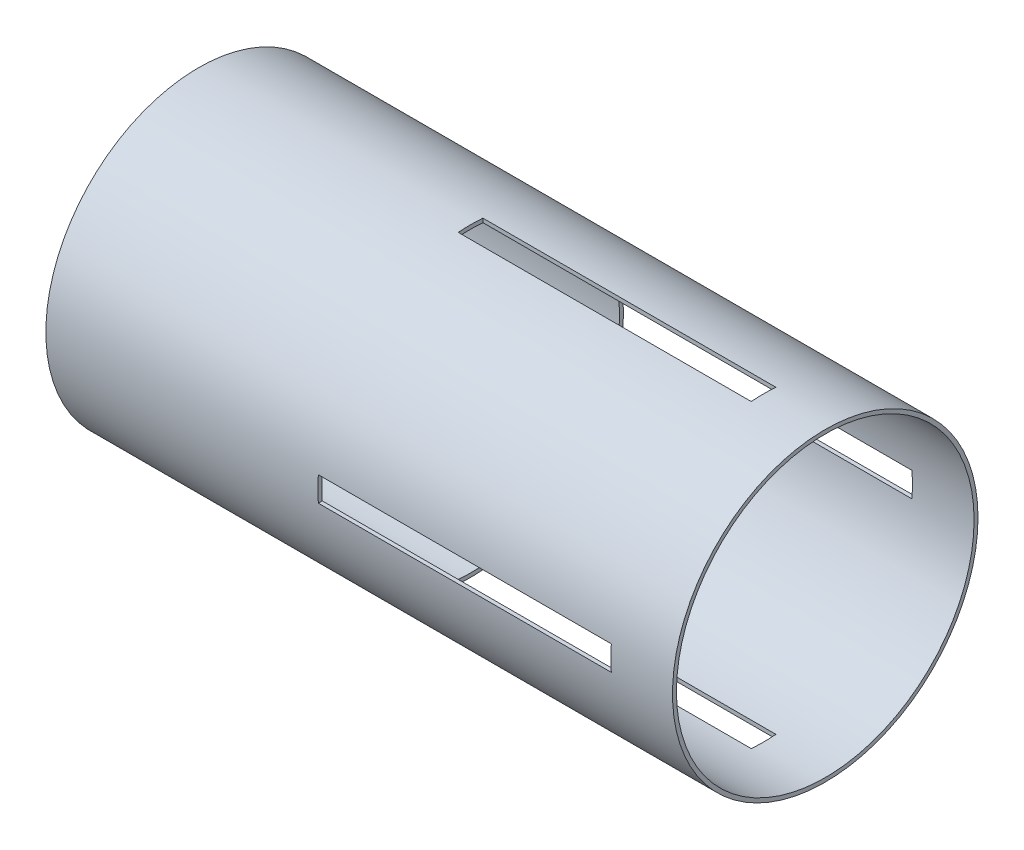
ISO-10303-21;
HEADER;
FILE_DESCRIPTION(('STEP AP214'),'2;1');
FILE_NAME('part.step','',(''),(''),'','','');
FILE_SCHEMA(('AUTOMOTIVE_DESIGN { 1 0 10303 214 1 1 1 1 }'));
ENDSEC;
DATA;
#1=APPLICATION_CONTEXT('core data for automotive mechanical design processes');
#2=APPLICATION_PROTOCOL_DEFINITION('international standard','automotive_design',2000,#1);
#3=PRODUCT_CONTEXT('',#1,'mechanical');
#4=PRODUCT('Part','Part','',(#3));
#5=PRODUCT_RELATED_PRODUCT_CATEGORY('part','',(#4));
#6=PRODUCT_DEFINITION_FORMATION('','',#4);
#7=PRODUCT_DEFINITION_CONTEXT('part definition',#1,'design');
#8=PRODUCT_DEFINITION('design','',#6,#7);
#9=PRODUCT_DEFINITION_SHAPE('','',#8);
#10=(LENGTH_UNIT() NAMED_UNIT(*) SI_UNIT(.MILLI.,.METRE.));
#11=(NAMED_UNIT(*) PLANE_ANGLE_UNIT() SI_UNIT($,.RADIAN.));
#12=(NAMED_UNIT(*) SI_UNIT($,.STERADIAN.) SOLID_ANGLE_UNIT());
#13=UNCERTAINTY_MEASURE_WITH_UNIT(LENGTH_MEASURE(1.E-05),#10,'distance_accuracy_value','');
#14=(GEOMETRIC_REPRESENTATION_CONTEXT(3) GLOBAL_UNCERTAINTY_ASSIGNED_CONTEXT((#13)) GLOBAL_UNIT_ASSIGNED_CONTEXT((#10,
#11,#12)) REPRESENTATION_CONTEXT('',''));
#15=CARTESIAN_POINT('',(0.,0.,0.));
#16=DIRECTION('',(0.,0.,1.));
#17=DIRECTION('',(1.,0.,0.));
#18=AXIS2_PLACEMENT_3D('',#15,#16,#17);
#19=CARTESIAN_POINT('',(203.2,0.,0.));
#20=DIRECTION('',(-1.,0.,0.));
#21=DIRECTION('',(0.,0.,1.));
#22=AXIS2_PLACEMENT_3D('',#19,#20,#21);
#23=CYLINDRICAL_SURFACE('',#22,48.26);
#24=CARTESIAN_POINT('',(203.2,0.,0.));
#25=DIRECTION('',(1.,0.,0.));
#26=DIRECTION('',(0.,0.,-1.));
#27=AXIS2_PLACEMENT_3D('',#24,#25,#26);
#28=CIRCLE('',#27,48.26);
#29=CARTESIAN_POINT('',(203.2,0.,-48.26));
#30=VERTEX_POINT('',#29);
#31=EDGE_CURVE('E220',#30,#30,#28,.T.);
#32=ORIENTED_EDGE('',*,*,#31,.T.);
#33=EDGE_LOOP('',(#32));
#34=FACE_BOUND('',#33,.T.);
#35=CARTESIAN_POINT('',(0.,0.,0.));
#36=DIRECTION('',(1.,0.,0.));
#37=DIRECTION('',(0.,0.,-1.));
#38=AXIS2_PLACEMENT_3D('',#35,#36,#37);
#39=CIRCLE('',#38,48.26);
#40=CARTESIAN_POINT('',(0.,0.,-48.26));
#41=VERTEX_POINT('',#40);
#42=EDGE_CURVE('E219',#41,#41,#39,.T.);
#43=ORIENTED_EDGE('',*,*,#42,.F.);
#44=EDGE_LOOP('',(#43));
#45=FACE_BOUND('',#44,.T.);
#46=CARTESIAN_POINT('',(183.2,0.,0.));
#47=DIRECTION('',(1.,0.,0.));
#48=DIRECTION('',(0.,0.,-1.));
#49=AXIS2_PLACEMENT_3D('',#46,#47,#48);
#50=CIRCLE('',#49,48.26);
#51=CARTESIAN_POINT('',(183.2,48.0939455649045,-4.));
#52=VERTEX_POINT('',#51);
#53=CARTESIAN_POINT('',(183.2,48.0939455649045,4.));
#54=VERTEX_POINT('',#53);
#55=EDGE_CURVE('E216',#52,#54,#50,.T.);
#56=ORIENTED_EDGE('',*,*,#55,.F.);
#57=DIRECTION('',(-1.,0.,0.));
#58=VECTOR('',#57,1.);
#59=CARTESIAN_POINT('',(203.2,48.0939455649045,-4.));
#60=LINE('',#59,#58);
#61=CARTESIAN_POINT('',(88.2,48.0939455649045,-4.));
#62=VERTEX_POINT('',#61);
#63=EDGE_CURVE('E211',#52,#62,#60,.T.);
#64=ORIENTED_EDGE('',*,*,#63,.T.);
#65=CARTESIAN_POINT('',(88.2,0.,0.));
#66=DIRECTION('',(-1.,0.,0.));
#67=DIRECTION('',(0.,0.,1.));
#68=AXIS2_PLACEMENT_3D('',#65,#66,#67);
#69=CIRCLE('',#68,48.26);
#70=CARTESIAN_POINT('',(88.2,48.0939455649045,4.));
#71=VERTEX_POINT('',#70);
#72=EDGE_CURVE('E214',#71,#62,#69,.T.);
#73=ORIENTED_EDGE('',*,*,#72,.F.);
#74=DIRECTION('',(-1.,0.,0.));
#75=VECTOR('',#74,1.);
#76=CARTESIAN_POINT('',(203.2,48.0939455649045,4.));
#77=LINE('',#76,#75);
#78=EDGE_CURVE('E205',#54,#71,#77,.T.);
#79=ORIENTED_EDGE('',*,*,#78,.F.);
#80=EDGE_LOOP('',(#56,#64,#73,#79));
#81=FACE_BOUND('',#80,.T.);
#82=CARTESIAN_POINT('',(183.2,0.,0.));
#83=DIRECTION('',(1.,0.,0.));
#84=DIRECTION('',(0.,0.,-1.));
#85=AXIS2_PLACEMENT_3D('',#82,#83,#84);
#86=CIRCLE('',#85,48.26);
#87=CARTESIAN_POINT('',(183.2,4.0000000000005,48.0939455649045));
#88=VERTEX_POINT('',#87);
#89=CARTESIAN_POINT('',(183.2,-3.9999999999995,48.0939455649046));
#90=VERTEX_POINT('',#89);
#91=EDGE_CURVE('E174',#88,#90,#86,.T.);
#92=ORIENTED_EDGE('',*,*,#91,.F.);
#93=DIRECTION('',(-1.,0.,0.));
#94=VECTOR('',#93,1.);
#95=CARTESIAN_POINT('',(203.2,4.0000000000005,48.0939455649045));
#96=LINE('',#95,#94);
#97=CARTESIAN_POINT('',(88.2,4.0000000000005,48.0939455649045));
#98=VERTEX_POINT('',#97);
#99=EDGE_CURVE('E161',#88,#98,#96,.T.);
#100=ORIENTED_EDGE('',*,*,#99,.T.);
#101=CARTESIAN_POINT('',(88.2,0.,0.));
#102=DIRECTION('',(-1.,0.,0.));
#103=DIRECTION('',(0.,0.,1.));
#104=AXIS2_PLACEMENT_3D('',#101,#102,#103);
#105=CIRCLE('',#104,48.26);
#106=CARTESIAN_POINT('',(88.2,-3.9999999999995,48.0939455649046));
#107=VERTEX_POINT('',#106);
#108=EDGE_CURVE('E167',#107,#98,#105,.T.);
#109=ORIENTED_EDGE('',*,*,#108,.F.);
#110=DIRECTION('',(-1.,0.,0.));
#111=VECTOR('',#110,1.);
#112=CARTESIAN_POINT('',(203.2,-3.9999999999995,48.0939455649046));
#113=LINE('',#112,#111);
#114=EDGE_CURVE('E150',#90,#107,#113,.T.);
#115=ORIENTED_EDGE('',*,*,#114,.F.);
#116=EDGE_LOOP('',(#92,#100,#109,#115));
#117=FACE_BOUND('',#116,.T.);
#118=CARTESIAN_POINT('',(183.2,0.,0.));
#119=DIRECTION('',(1.,0.,0.));
#120=DIRECTION('',(0.,0.,-1.));
#121=AXIS2_PLACEMENT_3D('',#118,#119,#120);
#122=CIRCLE('',#121,48.26);
#123=CARTESIAN_POINT('',(183.2,-48.0939455649045,4.));
#124=VERTEX_POINT('',#123);
#125=CARTESIAN_POINT('',(183.2,-48.0939455649045,-4.));
#126=VERTEX_POINT('',#125);
#127=EDGE_CURVE('E186',#124,#126,#122,.T.);
#128=ORIENTED_EDGE('',*,*,#127,.F.);
#129=DIRECTION('',(-1.,0.,0.));
#130=VECTOR('',#129,1.);
#131=CARTESIAN_POINT('',(203.2,-48.0939455649045,4.));
#132=LINE('',#131,#130);
#133=CARTESIAN_POINT('',(88.2,-48.0939455649045,4.));
#134=VERTEX_POINT('',#133);
#135=EDGE_CURVE('E181',#124,#134,#132,.T.);
#136=ORIENTED_EDGE('',*,*,#135,.T.);
#137=CARTESIAN_POINT('',(88.2,0.,0.));
#138=DIRECTION('',(-1.,0.,0.));
#139=DIRECTION('',(0.,0.,1.));
#140=AXIS2_PLACEMENT_3D('',#137,#138,#139);
#141=CIRCLE('',#140,48.26);
#142=CARTESIAN_POINT('',(88.2,-48.0939455649045,-4.));
#143=VERTEX_POINT('',#142);
#144=EDGE_CURVE('E184',#143,#134,#141,.T.);
#145=ORIENTED_EDGE('',*,*,#144,.F.);
#146=DIRECTION('',(-1.,0.,0.));
#147=VECTOR('',#146,1.);
#148=CARTESIAN_POINT('',(203.2,-48.0939455649045,-4.));
#149=LINE('',#148,#147);
#150=EDGE_CURVE('E176',#126,#143,#149,.T.);
#151=ORIENTED_EDGE('',*,*,#150,.F.);
#152=EDGE_LOOP('',(#128,#136,#145,#151));
#153=FACE_BOUND('',#152,.T.);
#154=CARTESIAN_POINT('',(183.2,0.,0.));
#155=DIRECTION('',(1.,0.,0.));
#156=DIRECTION('',(0.,0.,-1.));
#157=AXIS2_PLACEMENT_3D('',#154,#155,#156);
#158=CIRCLE('',#157,48.26);
#159=CARTESIAN_POINT('',(183.2,-4.00000000000017,-48.0939455649045));
#160=VERTEX_POINT('',#159);
#161=CARTESIAN_POINT('',(183.2,3.99999999999983,-48.0939455649045));
#162=VERTEX_POINT('',#161);
#163=EDGE_CURVE('E195',#160,#162,#158,.T.);
#164=ORIENTED_EDGE('',*,*,#163,.F.);
#165=DIRECTION('',(-1.,0.,0.));
#166=VECTOR('',#165,1.);
#167=CARTESIAN_POINT('',(203.2,-4.00000000000017,-48.0939455649045));
#168=LINE('',#167,#166);
#169=CARTESIAN_POINT('',(88.2,-4.00000000000017,-48.0939455649045));
#170=VERTEX_POINT('',#169);
#171=EDGE_CURVE('E190',#160,#170,#168,.T.);
#172=ORIENTED_EDGE('',*,*,#171,.T.);
#173=CARTESIAN_POINT('',(88.2,0.,0.));
#174=DIRECTION('',(-1.,0.,0.));
#175=DIRECTION('',(0.,0.,1.));
#176=AXIS2_PLACEMENT_3D('',#173,#174,#175);
#177=CIRCLE('',#176,48.26);
#178=CARTESIAN_POINT('',(88.2,3.99999999999983,-48.0939455649045));
#179=VERTEX_POINT('',#178);
#180=EDGE_CURVE('E193',#179,#170,#177,.T.);
#181=ORIENTED_EDGE('',*,*,#180,.F.);
#182=DIRECTION('',(-1.,0.,0.));
#183=VECTOR('',#182,1.);
#184=CARTESIAN_POINT('',(203.2,3.99999999999983,-48.0939455649045));
#185=LINE('',#184,#183);
#186=EDGE_CURVE('E188',#162,#179,#185,.T.);
#187=ORIENTED_EDGE('',*,*,#186,.F.);
#188=EDGE_LOOP('',(#164,#172,#181,#187));
#189=FACE_BOUND('',#188,.T.);
#190=ADVANCED_FACE('F39',(#34,#45,#81,#117,#153,#189),#23,.F.);
#191=CARTESIAN_POINT('',(203.2,0.,0.));
#192=DIRECTION('',(-1.,0.,0.));
#193=DIRECTION('',(0.,0.,1.));
#194=AXIS2_PLACEMENT_3D('',#191,#192,#193);
#195=CYLINDRICAL_SURFACE('',#194,49.53);
#196=DIRECTION('',(-1.,0.,0.));
#197=VECTOR('',#196,1.);
#198=CARTESIAN_POINT('',(203.2,4.00000000000052,49.3682175088386));
#199=LINE('',#198,#197);
#200=CARTESIAN_POINT('',(183.2,4.00000000000052,49.3682175088386));
#201=VERTEX_POINT('',#200);
#202=CARTESIAN_POINT('',(88.2,4.00000000000052,49.3682175088386));
#203=VERTEX_POINT('',#202);
#204=EDGE_CURVE('E248',#201,#203,#199,.T.);
#205=ORIENTED_EDGE('',*,*,#204,.F.);
#206=CARTESIAN_POINT('',(183.2,0.,0.));
#207=DIRECTION('',(1.,0.,0.));
#208=DIRECTION('',(0.,0.,-1.));
#209=AXIS2_PLACEMENT_3D('',#206,#207,#208);
#210=CIRCLE('',#209,49.53);
#211=CARTESIAN_POINT('',(183.2,-3.99999999999948,49.3682175088387));
#212=VERTEX_POINT('',#211);
#213=EDGE_CURVE('E245',#201,#212,#210,.T.);
#214=ORIENTED_EDGE('',*,*,#213,.T.);
#215=DIRECTION('',(-1.,0.,0.));
#216=VECTOR('',#215,1.);
#217=CARTESIAN_POINT('',(203.2,-3.99999999999948,49.3682175088387));
#218=LINE('',#217,#216);
#219=CARTESIAN_POINT('',(88.2,-3.99999999999948,49.3682175088387));
#220=VERTEX_POINT('',#219);
#221=EDGE_CURVE('E242',#212,#220,#218,.T.);
#222=ORIENTED_EDGE('',*,*,#221,.T.);
#223=CARTESIAN_POINT('',(88.2,0.,0.));
#224=DIRECTION('',(-1.,0.,0.));
#225=DIRECTION('',(0.,0.,1.));
#226=AXIS2_PLACEMENT_3D('',#223,#224,#225);
#227=CIRCLE('',#226,49.53);
#228=EDGE_CURVE('E169',#220,#203,#227,.T.);
#229=ORIENTED_EDGE('',*,*,#228,.T.);
#230=EDGE_LOOP('',(#205,#214,#222,#229));
#231=FACE_BOUND('',#230,.T.);
#232=CARTESIAN_POINT('',(0.,0.,0.));
#233=DIRECTION('',(1.,0.,0.));
#234=DIRECTION('',(0.,0.,-1.));
#235=AXIS2_PLACEMENT_3D('',#232,#233,#234);
#236=CIRCLE('',#235,49.53);
#237=CARTESIAN_POINT('',(0.,0.,-49.53));
#238=VERTEX_POINT('',#237);
#239=EDGE_CURVE('E224',#238,#238,#236,.T.);
#240=ORIENTED_EDGE('',*,*,#239,.T.);
#241=EDGE_LOOP('',(#240));
#242=FACE_BOUND('',#241,.T.);
#243=CARTESIAN_POINT('',(203.2,0.,0.));
#244=DIRECTION('',(1.,0.,0.));
#245=DIRECTION('',(0.,0.,-1.));
#246=AXIS2_PLACEMENT_3D('',#243,#244,#245);
#247=CIRCLE('',#246,49.53);
#248=CARTESIAN_POINT('',(203.2,0.,-49.53));
#249=VERTEX_POINT('',#248);
#250=EDGE_CURVE('E223',#249,#249,#247,.T.);
#251=ORIENTED_EDGE('',*,*,#250,.F.);
#252=EDGE_LOOP('',(#251));
#253=FACE_BOUND('',#252,.T.);
#254=CARTESIAN_POINT('',(88.2,0.,0.));
#255=DIRECTION('',(-1.,0.,0.));
#256=DIRECTION('',(0.,0.,1.));
#257=AXIS2_PLACEMENT_3D('',#254,#255,#256);
#258=CIRCLE('',#257,49.53);
#259=CARTESIAN_POINT('',(88.2,49.3682175088386,4.));
#260=VERTEX_POINT('',#259);
#261=CARTESIAN_POINT('',(88.2,49.3682175088386,-4.));
#262=VERTEX_POINT('',#261);
#263=EDGE_CURVE('E234',#260,#262,#258,.T.);
#264=ORIENTED_EDGE('',*,*,#263,.T.);
#265=DIRECTION('',(-1.,0.,0.));
#266=VECTOR('',#265,1.);
#267=CARTESIAN_POINT('',(203.2,49.3682175088386,-4.));
#268=LINE('',#267,#266);
#269=CARTESIAN_POINT('',(183.2,49.3682175088386,-4.));
#270=VERTEX_POINT('',#269);
#271=EDGE_CURVE('E239',#270,#262,#268,.T.);
#272=ORIENTED_EDGE('',*,*,#271,.F.);
#273=CARTESIAN_POINT('',(183.2,0.,0.));
#274=DIRECTION('',(1.,0.,0.));
#275=DIRECTION('',(0.,0.,-1.));
#276=AXIS2_PLACEMENT_3D('',#273,#274,#275);
#277=CIRCLE('',#276,49.53);
#278=CARTESIAN_POINT('',(183.2,49.3682175088386,4.));
#279=VERTEX_POINT('',#278);
#280=EDGE_CURVE('E236',#270,#279,#277,.T.);
#281=ORIENTED_EDGE('',*,*,#280,.T.);
#282=DIRECTION('',(-1.,0.,0.));
#283=VECTOR('',#282,1.);
#284=CARTESIAN_POINT('',(203.2,49.3682175088386,4.));
#285=LINE('',#284,#283);
#286=EDGE_CURVE('E227',#279,#260,#285,.T.);
#287=ORIENTED_EDGE('',*,*,#286,.T.);
#288=EDGE_LOOP('',(#264,#272,#281,#287));
#289=FACE_BOUND('',#288,.T.);
#290=CARTESIAN_POINT('',(88.2,0.,0.));
#291=DIRECTION('',(-1.,0.,0.));
#292=DIRECTION('',(0.,0.,1.));
#293=AXIS2_PLACEMENT_3D('',#290,#291,#292);
#294=CIRCLE('',#293,49.53);
#295=CARTESIAN_POINT('',(88.2,-49.3682175088386,-4.));
#296=VERTEX_POINT('',#295);
#297=CARTESIAN_POINT('',(88.2,-49.3682175088386,4.));
#298=VERTEX_POINT('',#297);
#299=EDGE_CURVE('E254',#296,#298,#294,.T.);
#300=ORIENTED_EDGE('',*,*,#299,.T.);
#301=DIRECTION('',(-1.,0.,0.));
#302=VECTOR('',#301,1.);
#303=CARTESIAN_POINT('',(203.2,-49.3682175088386,4.));
#304=LINE('',#303,#302);
#305=CARTESIAN_POINT('',(183.2,-49.3682175088386,4.));
#306=VERTEX_POINT('',#305);
#307=EDGE_CURVE('E259',#306,#298,#304,.T.);
#308=ORIENTED_EDGE('',*,*,#307,.F.);
#309=CARTESIAN_POINT('',(183.2,0.,0.));
#310=DIRECTION('',(1.,0.,0.));
#311=DIRECTION('',(0.,0.,-1.));
#312=AXIS2_PLACEMENT_3D('',#309,#310,#311);
#313=CIRCLE('',#312,49.53);
#314=CARTESIAN_POINT('',(183.2,-49.3682175088386,-4.));
#315=VERTEX_POINT('',#314);
#316=EDGE_CURVE('E256',#306,#315,#313,.T.);
#317=ORIENTED_EDGE('',*,*,#316,.T.);
#318=DIRECTION('',(-1.,0.,0.));
#319=VECTOR('',#318,1.);
#320=CARTESIAN_POINT('',(203.2,-49.3682175088386,-4.));
#321=LINE('',#320,#319);
#322=EDGE_CURVE('E251',#315,#296,#321,.T.);
#323=ORIENTED_EDGE('',*,*,#322,.T.);
#324=EDGE_LOOP('',(#300,#308,#317,#323));
#325=FACE_BOUND('',#324,.T.);
#326=DIRECTION('',(-1.,0.,0.));
#327=VECTOR('',#326,1.);
#328=CARTESIAN_POINT('',(203.2,-4.00000000000017,-49.3682175088386));
#329=LINE('',#328,#327);
#330=CARTESIAN_POINT('',(183.2,-4.00000000000017,-49.3682175088386));
#331=VERTEX_POINT('',#330);
#332=CARTESIAN_POINT('',(88.2,-4.00000000000017,-49.3682175088386));
#333=VERTEX_POINT('',#332);
#334=EDGE_CURVE('E11',#331,#333,#329,.T.);
#335=ORIENTED_EDGE('',*,*,#334,.F.);
#336=CARTESIAN_POINT('',(183.2,0.,0.));
#337=DIRECTION('',(1.,0.,0.));
#338=DIRECTION('',(0.,0.,-1.));
#339=AXIS2_PLACEMENT_3D('',#336,#337,#338);
#340=CIRCLE('',#339,49.53);
#341=CARTESIAN_POINT('',(183.2,3.99999999999983,-49.3682175088386));
#342=VERTEX_POINT('',#341);
#343=EDGE_CURVE('E46',#331,#342,#340,.T.);
#344=ORIENTED_EDGE('',*,*,#343,.T.);
#345=DIRECTION('',(-1.,0.,0.));
#346=VECTOR('',#345,1.);
#347=CARTESIAN_POINT('',(203.2,3.99999999999983,-49.3682175088386));
#348=LINE('',#347,#346);
#349=CARTESIAN_POINT('',(88.2,3.99999999999983,-49.3682175088386));
#350=VERTEX_POINT('',#349);
#351=EDGE_CURVE('E262',#342,#350,#348,.T.);
#352=ORIENTED_EDGE('',*,*,#351,.T.);
#353=CARTESIAN_POINT('',(88.2,0.,0.));
#354=DIRECTION('',(-1.,0.,0.));
#355=DIRECTION('',(0.,0.,1.));
#356=AXIS2_PLACEMENT_3D('',#353,#354,#355);
#357=CIRCLE('',#356,49.53);
#358=EDGE_CURVE('E265',#350,#333,#357,.T.);
#359=ORIENTED_EDGE('',*,*,#358,.T.);
#360=EDGE_LOOP('',(#335,#344,#352,#359));
#361=FACE_BOUND('',#360,.T.);
#362=ADVANCED_FACE('F269',(#231,#242,#253,#289,#325,#361),#195,.T.);
#363=CARTESIAN_POINT('',(203.2,0.,0.));
#364=DIRECTION('',(1.,0.,0.));
#365=DIRECTION('',(0.,0.,-1.));
#366=AXIS2_PLACEMENT_3D('',#363,#364,#365);
#367=PLANE('',#366);
#368=ORIENTED_EDGE('',*,*,#31,.F.);
#369=EDGE_LOOP('',(#368));
#370=FACE_BOUND('',#369,.T.);
#371=ORIENTED_EDGE('',*,*,#250,.T.);
#372=EDGE_LOOP('',(#371));
#373=FACE_BOUND('',#372,.T.);
#374=ADVANCED_FACE('F325',(#370,#373),#367,.T.);
#375=CARTESIAN_POINT('',(0.,0.,0.));
#376=DIRECTION('',(1.,0.,0.));
#377=DIRECTION('',(0.,0.,-1.));
#378=AXIS2_PLACEMENT_3D('',#375,#376,#377);
#379=PLANE('',#378);
#380=ORIENTED_EDGE('',*,*,#42,.T.);
#381=EDGE_LOOP('',(#380));
#382=FACE_BOUND('',#381,.T.);
#383=ORIENTED_EDGE('',*,*,#239,.F.);
#384=EDGE_LOOP('',(#383));
#385=FACE_BOUND('',#384,.T.);
#386=ADVANCED_FACE('F358',(#382,#385),#379,.F.);
#387=CARTESIAN_POINT('',(183.2,45.53,-4.));
#388=DIRECTION('',(1.,0.,0.));
#389=DIRECTION('',(0.,0.,-1.));
#390=AXIS2_PLACEMENT_3D('',#387,#388,#389);
#391=PLANE('',#390);
#392=ORIENTED_EDGE('',*,*,#55,.T.);
#393=DIRECTION('',(0.,1.,0.));
#394=VECTOR('',#393,1.);
#395=CARTESIAN_POINT('',(183.2,45.53,4.));
#396=LINE('',#395,#394);
#397=EDGE_CURVE('E202',#54,#279,#396,.T.);
#398=ORIENTED_EDGE('',*,*,#397,.T.);
#399=ORIENTED_EDGE('',*,*,#280,.F.);
#400=DIRECTION('',(0.,1.,0.));
#401=VECTOR('',#400,1.);
#402=CARTESIAN_POINT('',(183.2,45.53,-4.));
#403=LINE('',#402,#401);
#404=EDGE_CURVE('E201',#52,#270,#403,.T.);
#405=ORIENTED_EDGE('',*,*,#404,.F.);
#406=EDGE_LOOP('',(#392,#398,#399,#405));
#407=FACE_BOUND('',#406,.T.);
#408=ADVANCED_FACE('F335',(#407),#391,.F.);
#409=CARTESIAN_POINT('',(88.2,49.53,-4.));
#410=DIRECTION('',(-1.,0.,0.));
#411=DIRECTION('',(0.,0.,1.));
#412=AXIS2_PLACEMENT_3D('',#409,#410,#411);
#413=PLANE('',#412);
#414=ORIENTED_EDGE('',*,*,#72,.T.);
#415=DIRECTION('',(0.,-1.,0.));
#416=VECTOR('',#415,1.);
#417=CARTESIAN_POINT('',(88.2,49.53,-4.));
#418=LINE('',#417,#416);
#419=EDGE_CURVE('E198',#262,#62,#418,.T.);
#420=ORIENTED_EDGE('',*,*,#419,.F.);
#421=ORIENTED_EDGE('',*,*,#263,.F.);
#422=DIRECTION('',(0.,-1.,0.));
#423=VECTOR('',#422,1.);
#424=CARTESIAN_POINT('',(88.2,49.53,4.));
#425=LINE('',#424,#423);
#426=EDGE_CURVE('E197',#260,#71,#425,.T.);
#427=ORIENTED_EDGE('',*,*,#426,.T.);
#428=EDGE_LOOP('',(#414,#420,#421,#427));
#429=FACE_BOUND('',#428,.T.);
#430=ADVANCED_FACE('F344',(#429),#413,.F.);
#431=CARTESIAN_POINT('',(0.,0.,-4.));
#432=DIRECTION('',(0.,0.,1.));
#433=DIRECTION('',(1.,0.,0.));
#434=AXIS2_PLACEMENT_3D('',#431,#432,#433);
#435=PLANE('',#434);
#436=ORIENTED_EDGE('',*,*,#404,.T.);
#437=ORIENTED_EDGE('',*,*,#271,.T.);
#438=ORIENTED_EDGE('',*,*,#419,.T.);
#439=ORIENTED_EDGE('',*,*,#63,.F.);
#440=EDGE_LOOP('',(#436,#437,#438,#439));
#441=FACE_BOUND('',#440,.T.);
#442=ADVANCED_FACE('F338',(#441),#435,.T.);
#443=CARTESIAN_POINT('',(0.,0.,4.));
#444=DIRECTION('',(0.,0.,1.));
#445=DIRECTION('',(1.,0.,0.));
#446=AXIS2_PLACEMENT_3D('',#443,#444,#445);
#447=PLANE('',#446);
#448=ORIENTED_EDGE('',*,*,#78,.T.);
#449=ORIENTED_EDGE('',*,*,#426,.F.);
#450=ORIENTED_EDGE('',*,*,#286,.F.);
#451=ORIENTED_EDGE('',*,*,#397,.F.);
#452=EDGE_LOOP('',(#448,#449,#450,#451));
#453=FACE_BOUND('',#452,.T.);
#454=ADVANCED_FACE('F346',(#453),#447,.F.);
#455=CARTESIAN_POINT('',(183.2,4.00000000000048,45.5299999999999));
#456=DIRECTION('',(1.,0.,0.));
#457=DIRECTION('',(0.,0.,-1.));
#458=AXIS2_PLACEMENT_3D('',#455,#456,#457);
#459=PLANE('',#458);
#460=ORIENTED_EDGE('',*,*,#91,.T.);
#461=DIRECTION('',(0.,0.,1.));
#462=VECTOR('',#461,1.);
#463=CARTESIAN_POINT('',(183.2,-3.99999999999952,45.53));
#464=LINE('',#463,#462);
#465=EDGE_CURVE('E156',#90,#212,#464,.T.);
#466=ORIENTED_EDGE('',*,*,#465,.T.);
#467=ORIENTED_EDGE('',*,*,#213,.F.);
#468=DIRECTION('',(0.,0.,1.));
#469=VECTOR('',#468,1.);
#470=CARTESIAN_POINT('',(183.2,4.00000000000048,45.5299999999999));
#471=LINE('',#470,#469);
#472=EDGE_CURVE('E296',#88,#201,#471,.T.);
#473=ORIENTED_EDGE('',*,*,#472,.F.);
#474=EDGE_LOOP('',(#460,#466,#467,#473));
#475=FACE_BOUND('',#474,.T.);
#476=ADVANCED_FACE('F303',(#475),#459,.F.);
#477=CARTESIAN_POINT('',(88.2,4.00000000000052,49.5299999999999));
#478=DIRECTION('',(-1.,0.,0.));
#479=DIRECTION('',(0.,0.,1.));
#480=AXIS2_PLACEMENT_3D('',#477,#478,#479);
#481=PLANE('',#480);
#482=ORIENTED_EDGE('',*,*,#108,.T.);
#483=DIRECTION('',(0.,0.,-1.));
#484=VECTOR('',#483,1.);
#485=CARTESIAN_POINT('',(88.2,4.00000000000052,49.5299999999999));
#486=LINE('',#485,#484);
#487=EDGE_CURVE('E298',#203,#98,#486,.T.);
#488=ORIENTED_EDGE('',*,*,#487,.F.);
#489=ORIENTED_EDGE('',*,*,#228,.F.);
#490=DIRECTION('',(0.,0.,-1.));
#491=VECTOR('',#490,1.);
#492=CARTESIAN_POINT('',(88.2,-3.99999999999948,49.53));
#493=LINE('',#492,#491);
#494=EDGE_CURVE('E153',#220,#107,#493,.T.);
#495=ORIENTED_EDGE('',*,*,#494,.T.);
#496=EDGE_LOOP('',(#482,#488,#489,#495));
#497=FACE_BOUND('',#496,.T.);
#498=ADVANCED_FACE('F165',(#497),#481,.F.);
#499=CARTESIAN_POINT('',(0.,4.,0.));
#500=DIRECTION('',(0.,-1.,0.));
#501=DIRECTION('',(1.,0.,0.));
#502=AXIS2_PLACEMENT_3D('',#499,#500,#501);
#503=PLANE('',#502);
#504=ORIENTED_EDGE('',*,*,#472,.T.);
#505=ORIENTED_EDGE('',*,*,#204,.T.);
#506=ORIENTED_EDGE('',*,*,#487,.T.);
#507=ORIENTED_EDGE('',*,*,#99,.F.);
#508=EDGE_LOOP('',(#504,#505,#506,#507));
#509=FACE_BOUND('',#508,.T.);
#510=ADVANCED_FACE('F309',(#509),#503,.T.);
#511=CARTESIAN_POINT('',(0.,-4.,0.));
#512=DIRECTION('',(0.,-1.,0.));
#513=DIRECTION('',(1.,0.,0.));
#514=AXIS2_PLACEMENT_3D('',#511,#512,#513);
#515=PLANE('',#514);
#516=ORIENTED_EDGE('',*,*,#114,.T.);
#517=ORIENTED_EDGE('',*,*,#494,.F.);
#518=ORIENTED_EDGE('',*,*,#221,.F.);
#519=ORIENTED_EDGE('',*,*,#465,.F.);
#520=EDGE_LOOP('',(#516,#517,#518,#519));
#521=FACE_BOUND('',#520,.T.);
#522=ADVANCED_FACE('F152',(#521),#515,.F.);
#523=CARTESIAN_POINT('',(183.2,-45.53,4.));
#524=DIRECTION('',(1.,0.,0.));
#525=DIRECTION('',(0.,0.,-1.));
#526=AXIS2_PLACEMENT_3D('',#523,#524,#525);
#527=PLANE('',#526);
#528=ORIENTED_EDGE('',*,*,#127,.T.);
#529=DIRECTION('',(0.,-1.,0.));
#530=VECTOR('',#529,1.);
#531=CARTESIAN_POINT('',(183.2,-45.53,-4.));
#532=LINE('',#531,#530);
#533=EDGE_CURVE('E61',#126,#315,#532,.T.);
#534=ORIENTED_EDGE('',*,*,#533,.T.);
#535=ORIENTED_EDGE('',*,*,#316,.F.);
#536=DIRECTION('',(0.,-1.,0.));
#537=VECTOR('',#536,1.);
#538=CARTESIAN_POINT('',(183.2,-45.53,4.));
#539=LINE('',#538,#537);
#540=EDGE_CURVE('E286',#124,#306,#539,.T.);
#541=ORIENTED_EDGE('',*,*,#540,.F.);
#542=EDGE_LOOP('',(#528,#534,#535,#541));
#543=FACE_BOUND('',#542,.T.);
#544=ADVANCED_FACE('F316',(#543),#527,.F.);
#545=CARTESIAN_POINT('',(88.2,-49.53,4.));
#546=DIRECTION('',(-1.,0.,0.));
#547=DIRECTION('',(0.,0.,1.));
#548=AXIS2_PLACEMENT_3D('',#545,#546,#547);
#549=PLANE('',#548);
#550=ORIENTED_EDGE('',*,*,#144,.T.);
#551=DIRECTION('',(0.,1.,0.));
#552=VECTOR('',#551,1.);
#553=CARTESIAN_POINT('',(88.2,-49.53,4.));
#554=LINE('',#553,#552);
#555=EDGE_CURVE('E288',#298,#134,#554,.T.);
#556=ORIENTED_EDGE('',*,*,#555,.F.);
#557=ORIENTED_EDGE('',*,*,#299,.F.);
#558=DIRECTION('',(0.,1.,0.));
#559=VECTOR('',#558,1.);
#560=CARTESIAN_POINT('',(88.2,-49.53,-4.));
#561=LINE('',#560,#559);
#562=EDGE_CURVE('E293',#296,#143,#561,.T.);
#563=ORIENTED_EDGE('',*,*,#562,.T.);
#564=EDGE_LOOP('',(#550,#556,#557,#563));
#565=FACE_BOUND('',#564,.T.);
#566=ADVANCED_FACE('F433',(#565),#549,.F.);
#567=CARTESIAN_POINT('',(0.,0.,4.));
#568=DIRECTION('',(0.,0.,-1.));
#569=DIRECTION('',(1.,0.,0.));
#570=AXIS2_PLACEMENT_3D('',#567,#568,#569);
#571=PLANE('',#570);
#572=ORIENTED_EDGE('',*,*,#540,.T.);
#573=ORIENTED_EDGE('',*,*,#307,.T.);
#574=ORIENTED_EDGE('',*,*,#555,.T.);
#575=ORIENTED_EDGE('',*,*,#135,.F.);
#576=EDGE_LOOP('',(#572,#573,#574,#575));
#577=FACE_BOUND('',#576,.T.);
#578=ADVANCED_FACE('F443',(#577),#571,.T.);
#579=CARTESIAN_POINT('',(0.,0.,-4.));
#580=DIRECTION('',(0.,0.,-1.));
#581=DIRECTION('',(1.,0.,0.));
#582=AXIS2_PLACEMENT_3D('',#579,#580,#581);
#583=PLANE('',#582);
#584=ORIENTED_EDGE('',*,*,#150,.T.);
#585=ORIENTED_EDGE('',*,*,#562,.F.);
#586=ORIENTED_EDGE('',*,*,#322,.F.);
#587=ORIENTED_EDGE('',*,*,#533,.F.);
#588=EDGE_LOOP('',(#584,#585,#586,#587));
#589=FACE_BOUND('',#588,.T.);
#590=ADVANCED_FACE('F452',(#589),#583,.F.);
#591=CARTESIAN_POINT('',(183.2,-4.00000000000016,-45.53));
#592=DIRECTION('',(1.,0.,0.));
#593=DIRECTION('',(0.,0.,-1.));
#594=AXIS2_PLACEMENT_3D('',#591,#592,#593);
#595=PLANE('',#594);
#596=ORIENTED_EDGE('',*,*,#163,.T.);
#597=DIRECTION('',(0.,0.,-1.));
#598=VECTOR('',#597,1.);
#599=CARTESIAN_POINT('',(183.2,3.99999999999984,-45.53));
#600=LINE('',#599,#598);
#601=EDGE_CURVE('E53',#162,#342,#600,.T.);
#602=ORIENTED_EDGE('',*,*,#601,.T.);
#603=ORIENTED_EDGE('',*,*,#343,.F.);
#604=DIRECTION('',(0.,0.,-1.));
#605=VECTOR('',#604,1.);
#606=CARTESIAN_POINT('',(183.2,-4.00000000000016,-45.53));
#607=LINE('',#606,#605);
#608=EDGE_CURVE('E162',#160,#331,#607,.T.);
#609=ORIENTED_EDGE('',*,*,#608,.F.);
#610=EDGE_LOOP('',(#596,#602,#603,#609));
#611=FACE_BOUND('',#610,.T.);
#612=ADVANCED_FACE('F273',(#611),#595,.F.);
#613=CARTESIAN_POINT('',(88.2,-4.00000000000017,-49.53));
#614=DIRECTION('',(-1.,0.,0.));
#615=DIRECTION('',(0.,0.,1.));
#616=AXIS2_PLACEMENT_3D('',#613,#614,#615);
#617=PLANE('',#616);
#618=ORIENTED_EDGE('',*,*,#180,.T.);
#619=DIRECTION('',(0.,0.,1.));
#620=VECTOR('',#619,1.);
#621=CARTESIAN_POINT('',(88.2,-4.00000000000017,-49.53));
#622=LINE('',#621,#620);
#623=EDGE_CURVE('E279',#333,#170,#622,.T.);
#624=ORIENTED_EDGE('',*,*,#623,.F.);
#625=ORIENTED_EDGE('',*,*,#358,.F.);
#626=DIRECTION('',(0.,0.,1.));
#627=VECTOR('',#626,1.);
#628=CARTESIAN_POINT('',(88.2,3.99999999999983,-49.53));
#629=LINE('',#628,#627);
#630=EDGE_CURVE('E283',#350,#179,#629,.T.);
#631=ORIENTED_EDGE('',*,*,#630,.T.);
#632=EDGE_LOOP('',(#618,#624,#625,#631));
#633=FACE_BOUND('',#632,.T.);
#634=ADVANCED_FACE('F470',(#633),#617,.F.);
#635=CARTESIAN_POINT('',(0.,-4.,0.));
#636=DIRECTION('',(0.,1.,0.));
#637=DIRECTION('',(1.,0.,0.));
#638=AXIS2_PLACEMENT_3D('',#635,#636,#637);
#639=PLANE('',#638);
#640=ORIENTED_EDGE('',*,*,#608,.T.);
#641=ORIENTED_EDGE('',*,*,#334,.T.);
#642=ORIENTED_EDGE('',*,*,#623,.T.);
#643=ORIENTED_EDGE('',*,*,#171,.F.);
#644=EDGE_LOOP('',(#640,#641,#642,#643));
#645=FACE_BOUND('',#644,.T.);
#646=ADVANCED_FACE('F276',(#645),#639,.T.);
#647=CARTESIAN_POINT('',(0.,4.,0.));
#648=DIRECTION('',(0.,1.,0.));
#649=DIRECTION('',(1.,0.,0.));
#650=AXIS2_PLACEMENT_3D('',#647,#648,#649);
#651=PLANE('',#650);
#652=ORIENTED_EDGE('',*,*,#186,.T.);
#653=ORIENTED_EDGE('',*,*,#630,.F.);
#654=ORIENTED_EDGE('',*,*,#351,.F.);
#655=ORIENTED_EDGE('',*,*,#601,.F.);
#656=EDGE_LOOP('',(#652,#653,#654,#655));
#657=FACE_BOUND('',#656,.T.);
#658=ADVANCED_FACE('F488',(#657),#651,.F.);
#659=CLOSED_SHELL('',(#190,#362,#374,#386,#408,#430,#442,#454,#476,#498,#510,#522,#544,#566,
#578,#590,#612,#634,#646,#658));
#660=MANIFOLD_SOLID_BREP('B2',#659);
#661=ADVANCED_BREP_SHAPE_REPRESENTATION('',(#18,#660),#14);
#662=SHAPE_DEFINITION_REPRESENTATION(#9,#661);
ENDSEC;
END-ISO-10303-21;
